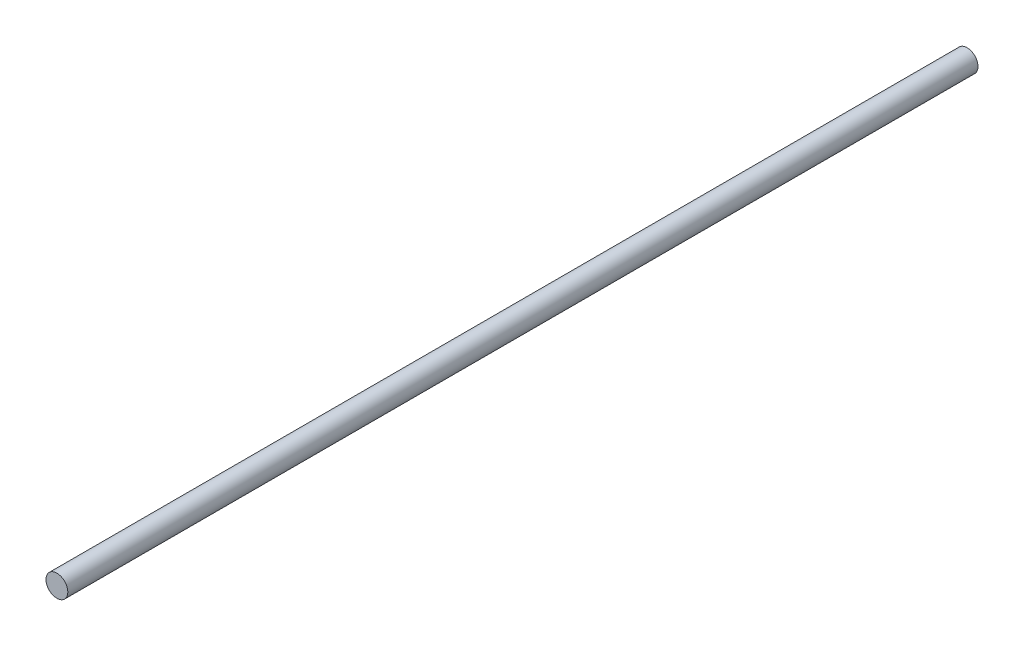
ISO-10303-21;
HEADER;
FILE_DESCRIPTION(('STEP AP214'),'2;1');
FILE_NAME('part.step','',(''),(''),'','','');
FILE_SCHEMA(('AUTOMOTIVE_DESIGN { 1 0 10303 214 1 1 1 1 }'));
ENDSEC;
DATA;
#1=APPLICATION_CONTEXT('core data for automotive mechanical design processes');
#2=APPLICATION_PROTOCOL_DEFINITION('international standard','automotive_design',2000,#1);
#3=PRODUCT_CONTEXT('',#1,'mechanical');
#4=PRODUCT('Part','Part','',(#3));
#5=PRODUCT_RELATED_PRODUCT_CATEGORY('part','',(#4));
#6=PRODUCT_DEFINITION_FORMATION('','',#4);
#7=PRODUCT_DEFINITION_CONTEXT('part definition',#1,'design');
#8=PRODUCT_DEFINITION('design','',#6,#7);
#9=PRODUCT_DEFINITION_SHAPE('','',#8);
#10=(LENGTH_UNIT() NAMED_UNIT(*) SI_UNIT(.MILLI.,.METRE.));
#11=(NAMED_UNIT(*) PLANE_ANGLE_UNIT() SI_UNIT($,.RADIAN.));
#12=(NAMED_UNIT(*) SI_UNIT($,.STERADIAN.) SOLID_ANGLE_UNIT());
#13=UNCERTAINTY_MEASURE_WITH_UNIT(LENGTH_MEASURE(1.E-05),#10,'distance_accuracy_value','');
#14=(GEOMETRIC_REPRESENTATION_CONTEXT(3) GLOBAL_UNCERTAINTY_ASSIGNED_CONTEXT((#13)) GLOBAL_UNIT_ASSIGNED_CONTEXT((#10,
#11,#12)) REPRESENTATION_CONTEXT('',''));
#15=CARTESIAN_POINT('',(0.,0.,0.));
#16=DIRECTION('',(0.,0.,1.));
#17=DIRECTION('',(1.,0.,0.));
#18=AXIS2_PLACEMENT_3D('',#15,#16,#17);
#19=CARTESIAN_POINT('',(0.,0.,250.35));
#20=DIRECTION('',(0.,0.,-1.));
#21=DIRECTION('',(-1.,0.,0.));
#22=AXIS2_PLACEMENT_3D('',#19,#20,#21);
#23=CYLINDRICAL_SURFACE('',#22,3.);
#24=CARTESIAN_POINT('',(0.,0.,250.35));
#25=DIRECTION('',(0.,0.,1.));
#26=DIRECTION('',(1.,0.,0.));
#27=AXIS2_PLACEMENT_3D('',#24,#25,#26);
#28=CIRCLE('',#27,3.);
#29=CARTESIAN_POINT('',(3.,0.,250.35));
#30=VERTEX_POINT('',#29);
#31=EDGE_CURVE('E10',#30,#30,#28,.T.);
#32=ORIENTED_EDGE('',*,*,#31,.F.);
#33=EDGE_LOOP('',(#32));
#34=FACE_BOUND('',#33,.T.);
#35=CARTESIAN_POINT('',(0.,0.,0.));
#36=DIRECTION('',(0.,0.,1.));
#37=DIRECTION('',(1.,0.,0.));
#38=AXIS2_PLACEMENT_3D('',#35,#36,#37);
#39=CIRCLE('',#38,3.);
#40=CARTESIAN_POINT('',(3.,0.,0.));
#41=VERTEX_POINT('',#40);
#42=EDGE_CURVE('E35',#41,#41,#39,.T.);
#43=ORIENTED_EDGE('',*,*,#42,.T.);
#44=EDGE_LOOP('',(#43));
#45=FACE_BOUND('',#44,.T.);
#46=ADVANCED_FACE('F32',(#34,#45),#23,.T.);
#47=CARTESIAN_POINT('',(0.,0.,250.35));
#48=DIRECTION('',(0.,0.,1.));
#49=DIRECTION('',(1.,0.,0.));
#50=AXIS2_PLACEMENT_3D('',#47,#48,#49);
#51=PLANE('',#50);
#52=ORIENTED_EDGE('',*,*,#31,.T.);
#53=EDGE_LOOP('',(#52));
#54=FACE_BOUND('',#53,.T.);
#55=ADVANCED_FACE('F47',(#54),#51,.T.);
#56=CARTESIAN_POINT('',(0.,0.,0.));
#57=DIRECTION('',(0.,0.,1.));
#58=DIRECTION('',(1.,0.,0.));
#59=AXIS2_PLACEMENT_3D('',#56,#57,#58);
#60=PLANE('',#59);
#61=ORIENTED_EDGE('',*,*,#42,.F.);
#62=EDGE_LOOP('',(#61));
#63=FACE_BOUND('',#62,.T.);
#64=ADVANCED_FACE('F45',(#63),#60,.F.);
#65=CLOSED_SHELL('',(#46,#55,#64));
#66=MANIFOLD_SOLID_BREP('B2',#65);
#67=ADVANCED_BREP_SHAPE_REPRESENTATION('',(#18,#66),#14);
#68=SHAPE_DEFINITION_REPRESENTATION(#9,#67);
ENDSEC;
END-ISO-10303-21;
